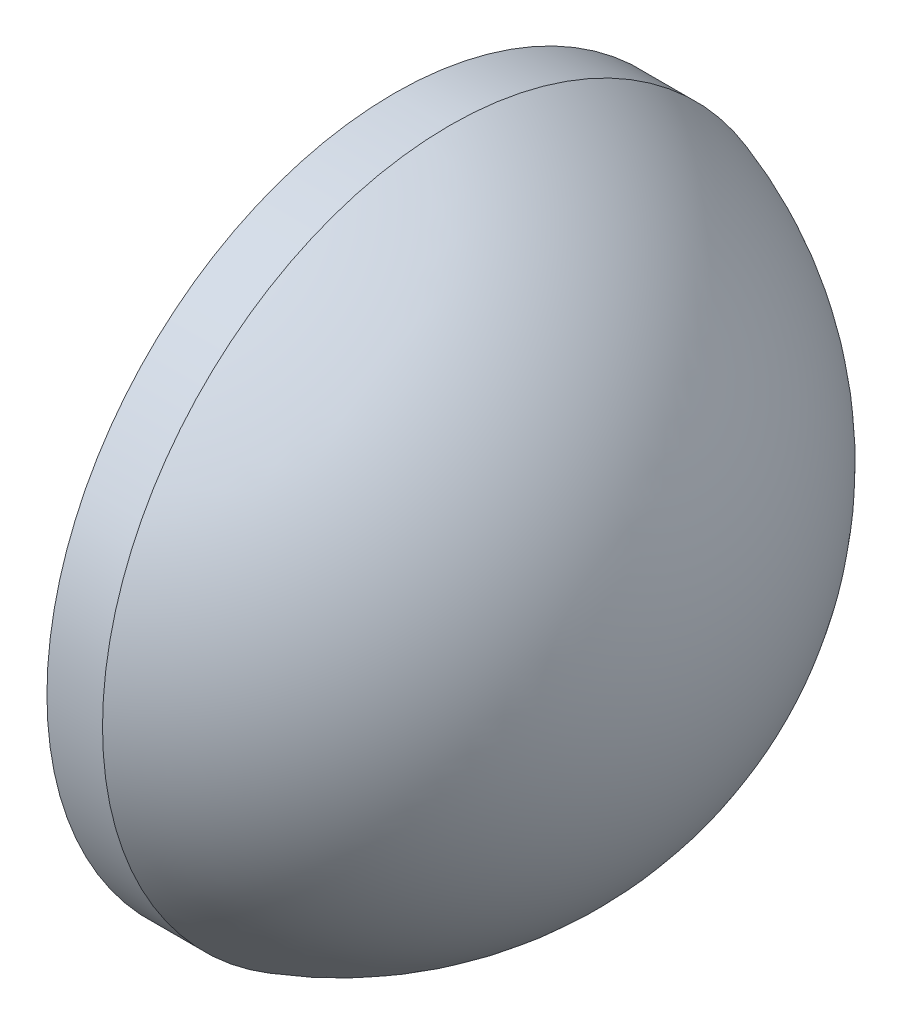
ISO-10303-21;
HEADER;
FILE_DESCRIPTION(('STEP AP214'),'2;1');
FILE_NAME('part.step','',(''),(''),'','','');
FILE_SCHEMA(('AUTOMOTIVE_DESIGN { 1 0 10303 214 1 1 1 1 }'));
ENDSEC;
DATA;
#1=APPLICATION_CONTEXT('core data for automotive mechanical design processes');
#2=APPLICATION_PROTOCOL_DEFINITION('international standard','automotive_design',2000,#1);
#3=PRODUCT_CONTEXT('',#1,'mechanical');
#4=PRODUCT('Part','Part','',(#3));
#5=PRODUCT_RELATED_PRODUCT_CATEGORY('part','',(#4));
#6=PRODUCT_DEFINITION_FORMATION('','',#4);
#7=PRODUCT_DEFINITION_CONTEXT('part definition',#1,'design');
#8=PRODUCT_DEFINITION('design','',#6,#7);
#9=PRODUCT_DEFINITION_SHAPE('','',#8);
#10=(LENGTH_UNIT() NAMED_UNIT(*) SI_UNIT(.MILLI.,.METRE.));
#11=(NAMED_UNIT(*) PLANE_ANGLE_UNIT() SI_UNIT($,.RADIAN.));
#12=(NAMED_UNIT(*) SI_UNIT($,.STERADIAN.) SOLID_ANGLE_UNIT());
#13=UNCERTAINTY_MEASURE_WITH_UNIT(LENGTH_MEASURE(1.E-05),#10,'distance_accuracy_value','');
#14=(GEOMETRIC_REPRESENTATION_CONTEXT(3) GLOBAL_UNCERTAINTY_ASSIGNED_CONTEXT((#13)) GLOBAL_UNIT_ASSIGNED_CONTEXT((#10,
#11,#12)) REPRESENTATION_CONTEXT('',''));
#15=CARTESIAN_POINT('',(0.,0.,0.));
#16=DIRECTION('',(0.,0.,1.));
#17=DIRECTION('',(1.,0.,0.));
#18=AXIS2_PLACEMENT_3D('',#15,#16,#17);
#19=CARTESIAN_POINT('',(203.335477823233,-102.691436271378,0.));
#20=DIRECTION('',(-1.,0.,0.));
#21=DIRECTION('',(0.,1.,0.));
#22=AXIS2_PLACEMENT_3D('',#19,#20,#21);
#23=SPHERICAL_SURFACE('',#22,13.1089301310044);
#24=CARTESIAN_POINT('',(207.284407954238,-102.691436271378,0.));
#25=DIRECTION('',(-1.,0.,0.));
#26=DIRECTION('',(0.,0.,1.));
#27=AXIS2_PLACEMENT_3D('',#24,#25,#26);
#28=CIRCLE('',#27,12.5);
#29=CARTESIAN_POINT('',(207.284407954238,-102.691436271378,12.5));
#30=VERTEX_POINT('',#29);
#31=EDGE_CURVE('E10',#30,#30,#28,.T.);
#32=ORIENTED_EDGE('',*,*,#31,.F.);
#33=EDGE_LOOP('',(#32));
#34=FACE_BOUND('',#33,.T.);
#35=ADVANCED_FACE('F33',(#34),#23,.T.);
#36=CARTESIAN_POINT('',(203.772376712348,-102.691436271378,0.));
#37=DIRECTION('',(-1.,0.,0.));
#38=DIRECTION('',(0.,0.,1.));
#39=AXIS2_PLACEMENT_3D('',#36,#37,#38);
#40=CYLINDRICAL_SURFACE('',#39,12.5);
#41=CARTESIAN_POINT('',(205.284407954238,-102.691436271378,0.));
#42=DIRECTION('',(-1.,0.,0.));
#43=DIRECTION('',(0.,0.,1.));
#44=AXIS2_PLACEMENT_3D('',#41,#42,#43);
#45=CIRCLE('',#44,12.5);
#46=CARTESIAN_POINT('',(205.284407954238,-102.691436271378,12.5));
#47=VERTEX_POINT('',#46);
#48=EDGE_CURVE('E39',#47,#47,#45,.T.);
#49=ORIENTED_EDGE('',*,*,#48,.F.);
#50=EDGE_LOOP('',(#49));
#51=FACE_BOUND('',#50,.T.);
#52=ORIENTED_EDGE('',*,*,#31,.T.);
#53=EDGE_LOOP('',(#52));
#54=FACE_BOUND('',#53,.T.);
#55=ADVANCED_FACE('F47',(#51,#54),#40,.T.);
#56=CARTESIAN_POINT('',(205.284407954238,-102.691436271378,0.));
#57=DIRECTION('',(1.,0.,0.));
#58=DIRECTION('',(0.,0.,-1.));
#59=AXIS2_PLACEMENT_3D('',#56,#57,#58);
#60=PLANE('',#59);
#61=ORIENTED_EDGE('',*,*,#48,.T.);
#62=EDGE_LOOP('',(#61));
#63=FACE_BOUND('',#62,.T.);
#64=ADVANCED_FACE('F45',(#63),#60,.F.);
#65=CLOSED_SHELL('',(#35,#55,#64));
#66=MANIFOLD_SOLID_BREP('B2',#65);
#67=ADVANCED_BREP_SHAPE_REPRESENTATION('',(#18,#66),#14);
#68=SHAPE_DEFINITION_REPRESENTATION(#9,#67);
ENDSEC;
END-ISO-10303-21;
